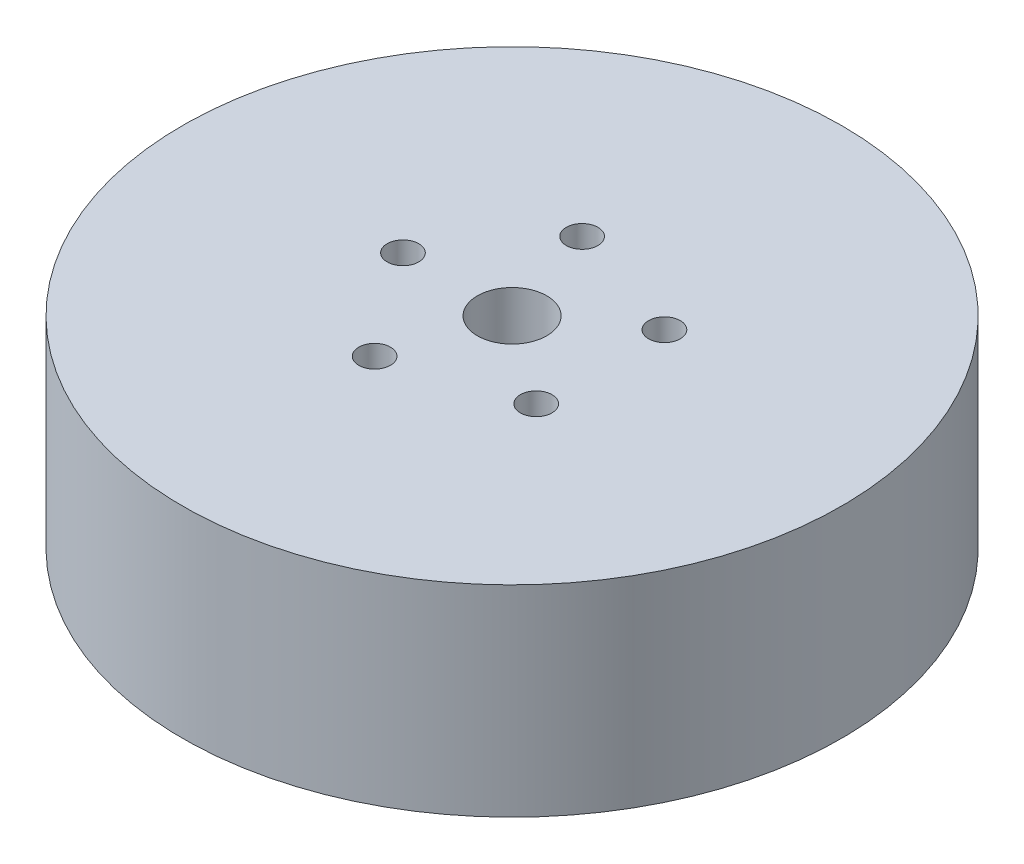
ISO-10303-21;
HEADER;
FILE_DESCRIPTION(('STEP AP214'),'2;1');
FILE_NAME('part.step','',(''),(''),'','','');
FILE_SCHEMA(('AUTOMOTIVE_DESIGN { 1 0 10303 214 1 1 1 1 }'));
ENDSEC;
DATA;
#1=APPLICATION_CONTEXT('core data for automotive mechanical design processes');
#2=APPLICATION_PROTOCOL_DEFINITION('international standard','automotive_design',2000,#1);
#3=PRODUCT_CONTEXT('',#1,'mechanical');
#4=PRODUCT('Part','Part','',(#3));
#5=PRODUCT_RELATED_PRODUCT_CATEGORY('part','',(#4));
#6=PRODUCT_DEFINITION_FORMATION('','',#4);
#7=PRODUCT_DEFINITION_CONTEXT('part definition',#1,'design');
#8=PRODUCT_DEFINITION('design','',#6,#7);
#9=PRODUCT_DEFINITION_SHAPE('','',#8);
#10=(LENGTH_UNIT() NAMED_UNIT(*) SI_UNIT(.MILLI.,.METRE.));
#11=(NAMED_UNIT(*) PLANE_ANGLE_UNIT() SI_UNIT($,.RADIAN.));
#12=(NAMED_UNIT(*) SI_UNIT($,.STERADIAN.) SOLID_ANGLE_UNIT());
#13=UNCERTAINTY_MEASURE_WITH_UNIT(LENGTH_MEASURE(1.E-05),#10,'distance_accuracy_value','');
#14=(GEOMETRIC_REPRESENTATION_CONTEXT(3) GLOBAL_UNCERTAINTY_ASSIGNED_CONTEXT((#13)) GLOBAL_UNIT_ASSIGNED_CONTEXT((#10,
#11,#12)) REPRESENTATION_CONTEXT('',''));
#15=CARTESIAN_POINT('',(0.,0.,0.));
#16=DIRECTION('',(0.,0.,1.));
#17=DIRECTION('',(1.,0.,0.));
#18=AXIS2_PLACEMENT_3D('',#15,#16,#17);
#19=CARTESIAN_POINT('',(0.,29.,0.));
#20=DIRECTION('',(0.,-1.,0.));
#21=DIRECTION('',(0.,0.,-1.));
#22=AXIS2_PLACEMENT_3D('',#19,#20,#21);
#23=CYLINDRICAL_SURFACE('',#22,47.5);
#24=CARTESIAN_POINT('',(0.,29.,0.));
#25=DIRECTION('',(0.,1.,0.));
#26=DIRECTION('',(0.,0.,1.));
#27=AXIS2_PLACEMENT_3D('',#24,#25,#26);
#28=CIRCLE('',#27,47.5);
#29=CARTESIAN_POINT('',(0.,29.,-47.5));
#30=VERTEX_POINT('',#29);
#31=EDGE_CURVE('E10',#30,#30,#28,.T.);
#32=CARTESIAN_POINT('',(0.,0.,0.));
#33=DIRECTION('',(0.,1.,0.));
#34=DIRECTION('',(0.,0.,1.));
#35=AXIS2_PLACEMENT_3D('',#32,#33,#34);
#36=CIRCLE('',#35,47.5);
#37=CARTESIAN_POINT('',(0.,0.,-47.5));
#38=VERTEX_POINT('',#37);
#39=EDGE_CURVE('E37',#38,#38,#36,.T.);
#40=CARTESIAN_POINT('',(0.,29.,-47.5));
#41=CARTESIAN_POINT('',(0.,28.6979166666667,-47.5));
#42=CARTESIAN_POINT('',(0.,28.3958333333333,-47.5));
#43=CARTESIAN_POINT('',(0.,27.7916666666667,-47.5));
#44=CARTESIAN_POINT('',(0.,27.4895833333333,-47.5));
#45=CARTESIAN_POINT('',(0.,26.8854166666667,-47.5));
#46=CARTESIAN_POINT('',(0.,26.5833333333333,-47.5));
#47=CARTESIAN_POINT('',(0.,25.9791666666667,-47.5));
#48=CARTESIAN_POINT('',(0.,25.6770833333333,-47.5));
#49=CARTESIAN_POINT('',(0.,25.0729166666667,-47.5));
#50=CARTESIAN_POINT('',(0.,24.7708333333333,-47.5));
#51=CARTESIAN_POINT('',(0.,24.1666666666667,-47.5));
#52=CARTESIAN_POINT('',(0.,23.8645833333333,-47.5));
#53=CARTESIAN_POINT('',(0.,23.2604166666667,-47.5));
#54=CARTESIAN_POINT('',(0.,22.9583333333333,-47.5));
#55=CARTESIAN_POINT('',(0.,22.3541666666667,-47.5));
#56=CARTESIAN_POINT('',(0.,22.0520833333333,-47.5));
#57=CARTESIAN_POINT('',(0.,21.4479166666667,-47.5));
#58=CARTESIAN_POINT('',(0.,21.1458333333333,-47.5));
#59=CARTESIAN_POINT('',(0.,20.5416666666667,-47.5));
#60=CARTESIAN_POINT('',(0.,20.2395833333333,-47.5));
#61=CARTESIAN_POINT('',(0.,19.6354166666667,-47.5));
#62=CARTESIAN_POINT('',(0.,19.3333333333333,-47.5));
#63=CARTESIAN_POINT('',(0.,18.7291666666667,-47.5));
#64=CARTESIAN_POINT('',(0.,18.4270833333333,-47.5));
#65=CARTESIAN_POINT('',(0.,17.8229166666667,-47.5));
#66=CARTESIAN_POINT('',(0.,17.5208333333333,-47.5));
#67=CARTESIAN_POINT('',(0.,16.9166666666667,-47.5));
#68=CARTESIAN_POINT('',(0.,16.6145833333333,-47.5));
#69=CARTESIAN_POINT('',(0.,16.0104166666667,-47.5));
#70=CARTESIAN_POINT('',(0.,15.7083333333333,-47.5));
#71=CARTESIAN_POINT('',(0.,15.1041666666667,-47.5));
#72=CARTESIAN_POINT('',(0.,14.8020833333333,-47.5));
#73=CARTESIAN_POINT('',(0.,14.1979166666667,-47.5));
#74=CARTESIAN_POINT('',(0.,13.8958333333333,-47.5));
#75=CARTESIAN_POINT('',(0.,13.2916666666667,-47.5));
#76=CARTESIAN_POINT('',(0.,12.9895833333333,-47.5));
#77=CARTESIAN_POINT('',(0.,12.3854166666667,-47.5));
#78=CARTESIAN_POINT('',(0.,12.0833333333333,-47.5));
#79=CARTESIAN_POINT('',(0.,11.4791666666667,-47.5));
#80=CARTESIAN_POINT('',(0.,11.1770833333333,-47.5));
#81=CARTESIAN_POINT('',(0.,10.5729166666667,-47.5));
#82=CARTESIAN_POINT('',(0.,10.2708333333333,-47.5));
#83=CARTESIAN_POINT('',(0.,9.66666666666667,-47.5));
#84=CARTESIAN_POINT('',(0.,9.36458333333333,-47.5));
#85=CARTESIAN_POINT('',(0.,8.76041666666667,-47.5));
#86=CARTESIAN_POINT('',(0.,8.45833333333333,-47.5));
#87=CARTESIAN_POINT('',(0.,7.85416666666667,-47.5));
#88=CARTESIAN_POINT('',(0.,7.55208333333333,-47.5));
#89=CARTESIAN_POINT('',(0.,6.94791666666667,-47.5));
#90=CARTESIAN_POINT('',(0.,6.64583333333333,-47.5));
#91=CARTESIAN_POINT('',(0.,6.04166666666667,-47.5));
#92=CARTESIAN_POINT('',(0.,5.73958333333333,-47.5));
#93=CARTESIAN_POINT('',(0.,5.13541666666667,-47.5));
#94=CARTESIAN_POINT('',(0.,4.83333333333333,-47.5));
#95=CARTESIAN_POINT('',(0.,4.22916666666667,-47.5));
#96=CARTESIAN_POINT('',(0.,3.92708333333333,-47.5));
#97=CARTESIAN_POINT('',(0.,3.32291666666667,-47.5));
#98=CARTESIAN_POINT('',(0.,3.02083333333333,-47.5));
#99=CARTESIAN_POINT('',(0.,2.41666666666667,-47.5));
#100=CARTESIAN_POINT('',(0.,2.11458333333333,-47.5));
#101=CARTESIAN_POINT('',(0.,1.51041666666667,-47.5));
#102=CARTESIAN_POINT('',(0.,1.20833333333333,-47.5));
#103=CARTESIAN_POINT('',(0.,0.604166666666667,-47.5));
#104=CARTESIAN_POINT('',(0.,0.302083333333333,-47.5));
#105=CARTESIAN_POINT('',(0.,0.,-47.5));
#106=B_SPLINE_CURVE_WITH_KNOTS('',3,(#40,#41,#42,#43,#44,#45,#46,#47,#48,#49,#50,#51,#52,#53,
#54,#55,#56,#57,#58,#59,#60,#61,#62,#63,#64,#65,#66,#67,#68,#69,#70,#71,#72,#73,#74,#75,#76,#77,
#78,#79,#80,#81,#82,#83,#84,#85,#86,#87,#88,#89,#90,#91,#92,#93,#94,#95,#96,#97,#98,#99,#100,
#101,#102,#103,#104,#105),.UNSPECIFIED.,.F.,.F.,(4,2,2,2,2,2,2,2,2,2,2,2,2,2,2,2,2,2,2,2,2,2,2,
2,2,2,2,2,2,2,2,2,4),(0.,0.906249999999997,1.8125,2.71875,3.625,4.53125,5.4375,6.34375,7.25,
8.15625,9.0625,9.96875,10.875,11.78125,12.6875,13.59375,14.5,15.40625,16.3125,17.21875,18.125,
19.03125,19.9375,20.84375,21.75,22.65625,23.5625,24.46875,25.375,26.28125,27.1875,28.09375,29.),.UNSPECIFIED.);
#107=EDGE_CURVE('BSEAM40',#30,#38,#106,.T.);
#108=ORIENTED_EDGE('',*,*,#31,.F.);
#109=ORIENTED_EDGE('',*,*,#39,.T.);
#110=ORIENTED_EDGE('',*,*,#107,.T.);
#111=ORIENTED_EDGE('',*,*,#107,.F.);
#112=EDGE_LOOP('',(#108,#110,#109,#111));
#113=FACE_BOUND('',#112,.T.);
#114=ADVANCED_FACE('F40',(#113),#23,.T.);
#115=CARTESIAN_POINT('',(0.,29.,0.));
#116=DIRECTION('',(0.,1.,0.));
#117=DIRECTION('',(0.,0.,1.));
#118=AXIS2_PLACEMENT_3D('',#115,#116,#117);
#119=PLANE('',#118);
#120=CARTESIAN_POINT('',(-4.85887961040355,29.,14.9540937860557));
#121=DIRECTION('',(0.,1.,0.));
#122=DIRECTION('',(0.951056516295155,0.,0.309016994374945));
#123=AXIS2_PLACEMENT_3D('',#120,#121,#122);
#124=CIRCLE('',#123,2.27992183137478);
#125=CARTESIAN_POINT('',(-2.69054509603098,29.,15.6586283777969));
#126=VERTEX_POINT('',#125);
#127=EDGE_CURVE('E78',#126,#126,#124,.T.);
#128=ORIENTED_EDGE('',*,*,#127,.F.);
#129=EDGE_LOOP('',(#128));
#130=FACE_BOUND('',#129,.T.);
#131=CARTESIAN_POINT('',(12.7207119672805,29.,9.24213823073592));
#132=DIRECTION('',(0.,1.,0.));
#133=DIRECTION('',(0.587785252292469,0.,-0.809016994374951));
#134=AXIS2_PLACEMENT_3D('',#131,#132,#133);
#135=CIRCLE('',#134,2.27992183137478);
#136=CARTESIAN_POINT('',(14.0608163961422,29.,7.39764272330726));
#137=VERTEX_POINT('',#136);
#138=EDGE_CURVE('E71',#137,#137,#135,.T.);
#139=ORIENTED_EDGE('',*,*,#138,.F.);
#140=EDGE_LOOP('',(#139));
#141=FACE_BOUND('',#140,.T.);
#142=CARTESIAN_POINT('',(12.7207119672804,29.,-9.2421382307361));
#143=DIRECTION('',(0.,1.,0.));
#144=DIRECTION('',(-0.58778525229248,0.,-0.809016994374942));
#145=AXIS2_PLACEMENT_3D('',#142,#143,#144);
#146=CIRCLE('',#145,2.27992183137478);
#147=CARTESIAN_POINT('',(11.3806075384186,29.,-11.0866337381647));
#148=VERTEX_POINT('',#147);
#149=EDGE_CURVE('E70',#148,#148,#146,.T.);
#150=ORIENTED_EDGE('',*,*,#149,.F.);
#151=EDGE_LOOP('',(#150));
#152=FACE_BOUND('',#151,.T.);
#153=CARTESIAN_POINT('',(-4.85887961040376,29.,-14.9540937860556));
#154=DIRECTION('',(0.,1.,0.));
#155=DIRECTION('',(-0.95105651629515,0.,0.309016994374958));
#156=AXIS2_PLACEMENT_3D('',#153,#154,#155);
#157=CIRCLE('',#156,2.27992183137478);
#158=CARTESIAN_POINT('',(-7.02721412477632,29.,-14.2495591943143));
#159=VERTEX_POINT('',#158);
#160=EDGE_CURVE('E61',#159,#159,#157,.T.);
#161=ORIENTED_EDGE('',*,*,#160,.F.);
#162=EDGE_LOOP('',(#161));
#163=FACE_BOUND('',#162,.T.);
#164=CARTESIAN_POINT('',(-15.7236647137537,29.,0.));
#165=DIRECTION('',(0.,1.,0.));
#166=DIRECTION('',(0.,0.,1.));
#167=AXIS2_PLACEMENT_3D('',#164,#165,#166);
#168=CIRCLE('',#167,2.27992183137478);
#169=CARTESIAN_POINT('',(-15.7236647137537,29.,2.27992183137478));
#170=VERTEX_POINT('',#169);
#171=EDGE_CURVE('E54',#170,#170,#168,.T.);
#172=ORIENTED_EDGE('',*,*,#171,.F.);
#173=EDGE_LOOP('',(#172));
#174=FACE_BOUND('',#173,.T.);
#175=CARTESIAN_POINT('',(0.,29.,0.));
#176=DIRECTION('',(0.,1.,0.));
#177=DIRECTION('',(0.,0.,1.));
#178=AXIS2_PLACEMENT_3D('',#175,#176,#177);
#179=CIRCLE('',#178,5.);
#180=CARTESIAN_POINT('',(0.,29.,-5.));
#181=VERTEX_POINT('',#180);
#182=EDGE_CURVE('E50',#181,#181,#179,.T.);
#183=ORIENTED_EDGE('',*,*,#182,.F.);
#184=EDGE_LOOP('',(#183));
#185=FACE_BOUND('',#184,.T.);
#186=ORIENTED_EDGE('',*,*,#31,.T.);
#187=EDGE_LOOP('',(#186));
#188=FACE_BOUND('',#187,.T.);
#189=ADVANCED_FACE('F94',(#130,#141,#152,#163,#174,#185,#188),#119,.T.);
#190=CARTESIAN_POINT('',(0.,0.,0.));
#191=DIRECTION('',(0.,1.,0.));
#192=DIRECTION('',(0.,0.,1.));
#193=AXIS2_PLACEMENT_3D('',#190,#191,#192);
#194=PLANE('',#193);
#195=CARTESIAN_POINT('',(0.,0.,0.));
#196=DIRECTION('',(0.,1.,0.));
#197=DIRECTION('',(0.,0.,1.));
#198=AXIS2_PLACEMENT_3D('',#195,#196,#197);
#199=CIRCLE('',#198,5.);
#200=CARTESIAN_POINT('',(0.,0.,-5.));
#201=VERTEX_POINT('',#200);
#202=EDGE_CURVE('E47',#201,#201,#199,.T.);
#203=ORIENTED_EDGE('',*,*,#202,.T.);
#204=EDGE_LOOP('',(#203));
#205=FACE_BOUND('',#204,.T.);
#206=ORIENTED_EDGE('',*,*,#39,.F.);
#207=EDGE_LOOP('',(#206));
#208=FACE_BOUND('',#207,.T.);
#209=ADVANCED_FACE('F100',(#205,#208),#194,.F.);
#210=CARTESIAN_POINT('',(0.,29.,0.));
#211=DIRECTION('',(0.,-1.,0.));
#212=DIRECTION('',(0.,0.,-1.));
#213=AXIS2_PLACEMENT_3D('',#210,#211,#212);
#214=CYLINDRICAL_SURFACE('',#213,5.);
#215=CARTESIAN_POINT('',(0.,29.,-5.));
#216=CARTESIAN_POINT('',(0.,28.6979166666667,-5.));
#217=CARTESIAN_POINT('',(0.,28.3958333333333,-5.));
#218=CARTESIAN_POINT('',(0.,27.7916666666667,-5.));
#219=CARTESIAN_POINT('',(0.,27.4895833333333,-5.));
#220=CARTESIAN_POINT('',(0.,26.8854166666667,-5.));
#221=CARTESIAN_POINT('',(0.,26.5833333333333,-5.));
#222=CARTESIAN_POINT('',(0.,25.9791666666667,-5.));
#223=CARTESIAN_POINT('',(0.,25.6770833333333,-5.));
#224=CARTESIAN_POINT('',(0.,25.0729166666667,-5.));
#225=CARTESIAN_POINT('',(0.,24.7708333333333,-5.));
#226=CARTESIAN_POINT('',(0.,24.1666666666667,-5.));
#227=CARTESIAN_POINT('',(0.,23.8645833333333,-5.));
#228=CARTESIAN_POINT('',(0.,23.2604166666667,-5.));
#229=CARTESIAN_POINT('',(0.,22.9583333333333,-5.));
#230=CARTESIAN_POINT('',(0.,22.3541666666667,-5.));
#231=CARTESIAN_POINT('',(0.,22.0520833333333,-5.));
#232=CARTESIAN_POINT('',(0.,21.4479166666667,-5.));
#233=CARTESIAN_POINT('',(0.,21.1458333333333,-5.));
#234=CARTESIAN_POINT('',(0.,20.5416666666667,-5.));
#235=CARTESIAN_POINT('',(0.,20.2395833333333,-5.));
#236=CARTESIAN_POINT('',(0.,19.6354166666667,-5.));
#237=CARTESIAN_POINT('',(0.,19.3333333333333,-5.));
#238=CARTESIAN_POINT('',(0.,18.7291666666667,-5.));
#239=CARTESIAN_POINT('',(0.,18.4270833333333,-5.));
#240=CARTESIAN_POINT('',(0.,17.8229166666667,-5.));
#241=CARTESIAN_POINT('',(0.,17.5208333333333,-5.));
#242=CARTESIAN_POINT('',(0.,16.9166666666667,-5.));
#243=CARTESIAN_POINT('',(0.,16.6145833333333,-5.));
#244=CARTESIAN_POINT('',(0.,16.0104166666667,-5.));
#245=CARTESIAN_POINT('',(0.,15.7083333333333,-5.));
#246=CARTESIAN_POINT('',(0.,15.1041666666667,-5.));
#247=CARTESIAN_POINT('',(0.,14.8020833333333,-5.));
#248=CARTESIAN_POINT('',(0.,14.1979166666667,-5.));
#249=CARTESIAN_POINT('',(0.,13.8958333333333,-5.));
#250=CARTESIAN_POINT('',(0.,13.2916666666667,-5.));
#251=CARTESIAN_POINT('',(0.,12.9895833333333,-5.));
#252=CARTESIAN_POINT('',(0.,12.3854166666667,-5.));
#253=CARTESIAN_POINT('',(0.,12.0833333333333,-5.));
#254=CARTESIAN_POINT('',(0.,11.4791666666667,-5.));
#255=CARTESIAN_POINT('',(0.,11.1770833333333,-5.));
#256=CARTESIAN_POINT('',(0.,10.5729166666667,-5.));
#257=CARTESIAN_POINT('',(0.,10.2708333333333,-5.));
#258=CARTESIAN_POINT('',(0.,9.66666666666667,-5.));
#259=CARTESIAN_POINT('',(0.,9.36458333333333,-5.));
#260=CARTESIAN_POINT('',(0.,8.76041666666667,-5.));
#261=CARTESIAN_POINT('',(0.,8.45833333333333,-5.));
#262=CARTESIAN_POINT('',(0.,7.85416666666667,-5.));
#263=CARTESIAN_POINT('',(0.,7.55208333333333,-5.));
#264=CARTESIAN_POINT('',(0.,6.94791666666667,-5.));
#265=CARTESIAN_POINT('',(0.,6.64583333333333,-5.));
#266=CARTESIAN_POINT('',(0.,6.04166666666667,-5.));
#267=CARTESIAN_POINT('',(0.,5.73958333333333,-5.));
#268=CARTESIAN_POINT('',(0.,5.13541666666667,-5.));
#269=CARTESIAN_POINT('',(0.,4.83333333333333,-5.));
#270=CARTESIAN_POINT('',(0.,4.22916666666667,-5.));
#271=CARTESIAN_POINT('',(0.,3.92708333333333,-5.));
#272=CARTESIAN_POINT('',(0.,3.32291666666667,-5.));
#273=CARTESIAN_POINT('',(0.,3.02083333333333,-5.));
#274=CARTESIAN_POINT('',(0.,2.41666666666667,-5.));
#275=CARTESIAN_POINT('',(0.,2.11458333333333,-5.));
#276=CARTESIAN_POINT('',(0.,1.51041666666667,-5.));
#277=CARTESIAN_POINT('',(0.,1.20833333333333,-5.));
#278=CARTESIAN_POINT('',(0.,0.604166666666667,-5.));
#279=CARTESIAN_POINT('',(0.,0.302083333333333,-5.));
#280=CARTESIAN_POINT('',(0.,0.,-5.));
#281=B_SPLINE_CURVE_WITH_KNOTS('',3,(#215,#216,#217,#218,#219,#220,#221,#222,#223,#224,#225,
#226,#227,#228,#229,#230,#231,#232,#233,#234,#235,#236,#237,#238,#239,#240,#241,#242,#243,#244,
#245,#246,#247,#248,#249,#250,#251,#252,#253,#254,#255,#256,#257,#258,#259,#260,#261,#262,#263,
#264,#265,#266,#267,#268,#269,#270,#271,#272,#273,#274,#275,#276,#277,#278,#279,#280),
.UNSPECIFIED.,.F.,.F.,(4,2,2,2,2,2,2,2,2,2,2,2,2,2,2,2,2,2,2,2,2,2,2,2,2,2,2,2,2,2,2,2,4),(0.,
0.906249999999997,1.8125,2.71875,3.625,4.53125,5.4375,6.34375,7.25,8.15625,9.0625,9.96875,
10.875,11.78125,12.6875,13.59375,14.5,15.40625,16.3125,17.21875,18.125,19.03125,19.9375,
20.84375,21.75,22.65625,23.5625,24.46875,25.375,26.28125,27.1875,28.09375,29.),.UNSPECIFIED.);
#282=EDGE_CURVE('BSEAM108',#181,#201,#281,.T.);
#283=ORIENTED_EDGE('',*,*,#182,.T.);
#284=ORIENTED_EDGE('',*,*,#202,.F.);
#285=ORIENTED_EDGE('',*,*,#282,.T.);
#286=ORIENTED_EDGE('',*,*,#282,.F.);
#287=EDGE_LOOP('',(#283,#285,#284,#286));
#288=FACE_BOUND('',#287,.T.);
#289=ADVANCED_FACE('F108',(#288),#214,.F.);
#290=CARTESIAN_POINT('',(-15.7236647137537,1.63952370490107,0.));
#291=DIRECTION('',(0.,1.,0.));
#292=DIRECTION('',(0.,0.,1.));
#293=AXIS2_PLACEMENT_3D('',#290,#291,#292);
#294=CYLINDRICAL_SURFACE('',#293,2.27992183137478);
#295=CARTESIAN_POINT('',(-15.7236647137537,1.63952370490107,0.));
#296=DIRECTION('',(0.,1.,0.));
#297=DIRECTION('',(0.,0.,1.));
#298=AXIS2_PLACEMENT_3D('',#295,#296,#297);
#299=CIRCLE('',#298,2.27992183137478);
#300=CARTESIAN_POINT('',(-15.7236647137537,1.63952370490107,2.27992183137478));
#301=VERTEX_POINT('',#300);
#302=EDGE_CURVE('E55',#301,#301,#299,.T.);
#303=ORIENTED_EDGE('',*,*,#302,.F.);
#304=EDGE_LOOP('',(#303));
#305=FACE_BOUND('',#304,.T.);
#306=ORIENTED_EDGE('',*,*,#171,.T.);
#307=EDGE_LOOP('',(#306));
#308=FACE_BOUND('',#307,.T.);
#309=ADVANCED_FACE('F115',(#305,#308),#294,.F.);
#310=CARTESIAN_POINT('',(-15.7236647137537,1.63952370490107,0.));
#311=DIRECTION('',(0.,1.,0.));
#312=DIRECTION('',(0.,0.,1.));
#313=AXIS2_PLACEMENT_3D('',#310,#311,#312);
#314=PLANE('',#313);
#315=ORIENTED_EDGE('',*,*,#302,.T.);
#316=EDGE_LOOP('',(#315));
#317=FACE_BOUND('',#316,.T.);
#318=ADVANCED_FACE('F142',(#317),#314,.T.);
#319=CARTESIAN_POINT('',(-4.85887961040376,1.63952370490107,-14.9540937860556));
#320=DIRECTION('',(0.,1.,0.));
#321=DIRECTION('',(0.,0.,1.));
#322=AXIS2_PLACEMENT_3D('',#319,#320,#321);
#323=CYLINDRICAL_SURFACE('',#322,2.27992183137478);
#324=CARTESIAN_POINT('',(-4.85887961040376,1.63952370490107,-14.9540937860556));
#325=DIRECTION('',(0.,1.,0.));
#326=DIRECTION('',(-0.95105651629515,0.,0.309016994374958));
#327=AXIS2_PLACEMENT_3D('',#324,#325,#326);
#328=CIRCLE('',#327,2.27992183137478);
#329=CARTESIAN_POINT('',(-7.02721412477632,1.63952370490107,-14.2495591943143));
#330=VERTEX_POINT('',#329);
#331=EDGE_CURVE('E63',#330,#330,#328,.T.);
#332=ORIENTED_EDGE('',*,*,#331,.F.);
#333=EDGE_LOOP('',(#332));
#334=FACE_BOUND('',#333,.T.);
#335=ORIENTED_EDGE('',*,*,#160,.T.);
#336=EDGE_LOOP('',(#335));
#337=FACE_BOUND('',#336,.T.);
#338=ADVANCED_FACE('F147',(#334,#337),#323,.F.);
#339=CARTESIAN_POINT('',(-4.85887961040376,1.63952370490107,-14.9540937860556));
#340=DIRECTION('',(0.,1.,0.));
#341=DIRECTION('',(-0.95105651629515,0.,0.309016994374958));
#342=AXIS2_PLACEMENT_3D('',#339,#340,#341);
#343=PLANE('',#342);
#344=ORIENTED_EDGE('',*,*,#331,.T.);
#345=EDGE_LOOP('',(#344));
#346=FACE_BOUND('',#345,.T.);
#347=ADVANCED_FACE('F163',(#346),#343,.T.);
#348=CARTESIAN_POINT('',(12.7207119672804,1.63952370490107,-9.2421382307361));
#349=DIRECTION('',(0.,1.,0.));
#350=DIRECTION('',(0.,0.,1.));
#351=AXIS2_PLACEMENT_3D('',#348,#349,#350);
#352=CYLINDRICAL_SURFACE('',#351,2.27992183137478);
#353=CARTESIAN_POINT('',(12.7207119672804,1.63952370490107,-9.2421382307361));
#354=DIRECTION('',(0.,1.,0.));
#355=DIRECTION('',(-0.58778525229248,0.,-0.809016994374942));
#356=AXIS2_PLACEMENT_3D('',#353,#354,#355);
#357=CIRCLE('',#356,2.27992183137478);
#358=CARTESIAN_POINT('',(11.3806075384186,1.63952370490107,-11.0866337381647));
#359=VERTEX_POINT('',#358);
#360=EDGE_CURVE('E69',#359,#359,#357,.T.);
#361=ORIENTED_EDGE('',*,*,#360,.F.);
#362=EDGE_LOOP('',(#361));
#363=FACE_BOUND('',#362,.T.);
#364=ORIENTED_EDGE('',*,*,#149,.T.);
#365=EDGE_LOOP('',(#364));
#366=FACE_BOUND('',#365,.T.);
#367=ADVANCED_FACE('F172',(#363,#366),#352,.F.);
#368=CARTESIAN_POINT('',(12.7207119672804,1.63952370490107,-9.2421382307361));
#369=DIRECTION('',(0.,1.,0.));
#370=DIRECTION('',(-0.58778525229248,0.,-0.809016994374942));
#371=AXIS2_PLACEMENT_3D('',#368,#369,#370);
#372=PLANE('',#371);
#373=ORIENTED_EDGE('',*,*,#360,.T.);
#374=EDGE_LOOP('',(#373));
#375=FACE_BOUND('',#374,.T.);
#376=ADVANCED_FACE('F185',(#375),#372,.T.);
#377=CARTESIAN_POINT('',(12.7207119672805,1.63952370490107,9.24213823073592));
#378=DIRECTION('',(0.,1.,0.));
#379=DIRECTION('',(0.,0.,1.));
#380=AXIS2_PLACEMENT_3D('',#377,#378,#379);
#381=CYLINDRICAL_SURFACE('',#380,2.27992183137478);
#382=CARTESIAN_POINT('',(12.7207119672805,1.63952370490107,9.24213823073592));
#383=DIRECTION('',(0.,1.,0.));
#384=DIRECTION('',(0.587785252292469,0.,-0.809016994374951));
#385=AXIS2_PLACEMENT_3D('',#382,#383,#384);
#386=CIRCLE('',#385,2.27992183137478);
#387=CARTESIAN_POINT('',(14.0608163961422,1.63952370490107,7.39764272330726));
#388=VERTEX_POINT('',#387);
#389=EDGE_CURVE('E76',#388,#388,#386,.T.);
#390=ORIENTED_EDGE('',*,*,#389,.F.);
#391=EDGE_LOOP('',(#390));
#392=FACE_BOUND('',#391,.T.);
#393=ORIENTED_EDGE('',*,*,#138,.T.);
#394=EDGE_LOOP('',(#393));
#395=FACE_BOUND('',#394,.T.);
#396=ADVANCED_FACE('F191',(#392,#395),#381,.F.);
#397=CARTESIAN_POINT('',(12.7207119672805,1.63952370490107,9.24213823073592));
#398=DIRECTION('',(0.,1.,0.));
#399=DIRECTION('',(0.587785252292469,0.,-0.809016994374951));
#400=AXIS2_PLACEMENT_3D('',#397,#398,#399);
#401=PLANE('',#400);
#402=ORIENTED_EDGE('',*,*,#389,.T.);
#403=EDGE_LOOP('',(#402));
#404=FACE_BOUND('',#403,.T.);
#405=ADVANCED_FACE('F89',(#404),#401,.T.);
#406=CARTESIAN_POINT('',(-4.85887961040355,1.63952370490107,14.9540937860557));
#407=DIRECTION('',(0.,1.,0.));
#408=DIRECTION('',(0.,0.,1.));
#409=AXIS2_PLACEMENT_3D('',#406,#407,#408);
#410=CYLINDRICAL_SURFACE('',#409,2.27992183137478);
#411=CARTESIAN_POINT('',(-4.85887961040355,1.63952370490107,14.9540937860557));
#412=DIRECTION('',(0.,1.,0.));
#413=DIRECTION('',(0.951056516295155,0.,0.309016994374945));
#414=AXIS2_PLACEMENT_3D('',#411,#412,#413);
#415=CIRCLE('',#414,2.27992183137478);
#416=CARTESIAN_POINT('',(-2.69054509603098,1.63952370490107,15.6586283777969));
#417=VERTEX_POINT('',#416);
#418=EDGE_CURVE('E59',#417,#417,#415,.T.);
#419=ORIENTED_EDGE('',*,*,#418,.F.);
#420=EDGE_LOOP('',(#419));
#421=FACE_BOUND('',#420,.T.);
#422=ORIENTED_EDGE('',*,*,#127,.T.);
#423=EDGE_LOOP('',(#422));
#424=FACE_BOUND('',#423,.T.);
#425=ADVANCED_FACE('F87',(#421,#424),#410,.F.);
#426=CARTESIAN_POINT('',(-4.85887961040355,1.63952370490107,14.9540937860557));
#427=DIRECTION('',(0.,1.,0.));
#428=DIRECTION('',(0.951056516295155,0.,0.309016994374945));
#429=AXIS2_PLACEMENT_3D('',#426,#427,#428);
#430=PLANE('',#429);
#431=ORIENTED_EDGE('',*,*,#418,.T.);
#432=EDGE_LOOP('',(#431));
#433=FACE_BOUND('',#432,.T.);
#434=ADVANCED_FACE('F84',(#433),#430,.T.);
#435=CLOSED_SHELL('',(#114,#189,#209,#289,#309,#318,#338,#347,#367,#376,#396,#405,#425,#434));
#436=MANIFOLD_SOLID_BREP('B2',#435);
#437=ADVANCED_BREP_SHAPE_REPRESENTATION('',(#18,#436),#14);
#438=SHAPE_DEFINITION_REPRESENTATION(#9,#437);
ENDSEC;
END-ISO-10303-21;
